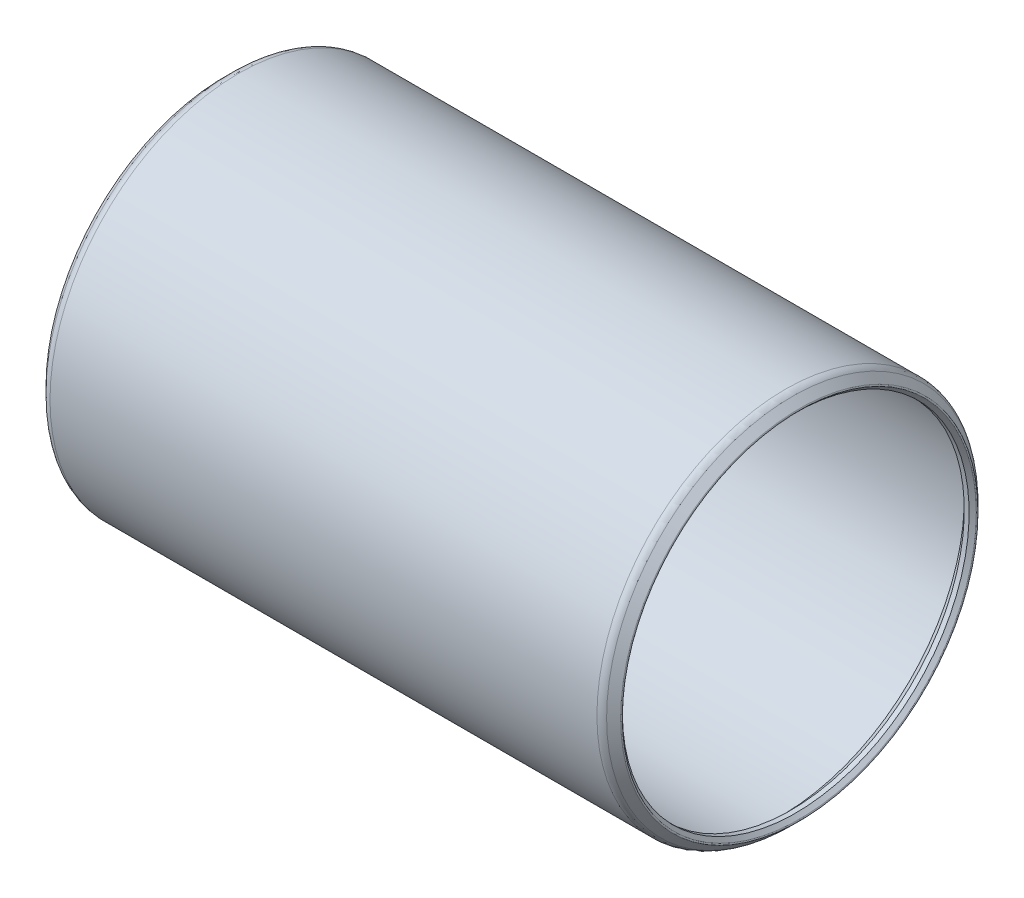
ISO-10303-21;
HEADER;
FILE_DESCRIPTION(('STEP AP214'),'2;1');
FILE_NAME('part.step','',(''),(''),'','','');
FILE_SCHEMA(('AUTOMOTIVE_DESIGN { 1 0 10303 214 1 1 1 1 }'));
ENDSEC;
DATA;
#1=APPLICATION_CONTEXT('core data for automotive mechanical design processes');
#2=APPLICATION_PROTOCOL_DEFINITION('international standard','automotive_design',2000,#1);
#3=PRODUCT_CONTEXT('',#1,'mechanical');
#4=PRODUCT('Part','Part','',(#3));
#5=PRODUCT_RELATED_PRODUCT_CATEGORY('part','',(#4));
#6=PRODUCT_DEFINITION_FORMATION('','',#4);
#7=PRODUCT_DEFINITION_CONTEXT('part definition',#1,'design');
#8=PRODUCT_DEFINITION('design','',#6,#7);
#9=PRODUCT_DEFINITION_SHAPE('','',#8);
#10=(LENGTH_UNIT() NAMED_UNIT(*) SI_UNIT(.MILLI.,.METRE.));
#11=(NAMED_UNIT(*) PLANE_ANGLE_UNIT() SI_UNIT($,.RADIAN.));
#12=(NAMED_UNIT(*) SI_UNIT($,.STERADIAN.) SOLID_ANGLE_UNIT());
#13=UNCERTAINTY_MEASURE_WITH_UNIT(LENGTH_MEASURE(1.E-05),#10,'distance_accuracy_value','');
#14=(GEOMETRIC_REPRESENTATION_CONTEXT(3) GLOBAL_UNCERTAINTY_ASSIGNED_CONTEXT((#13)) GLOBAL_UNIT_ASSIGNED_CONTEXT((#10,
#11,#12)) REPRESENTATION_CONTEXT('',''));
#15=CARTESIAN_POINT('',(0.,0.,0.));
#16=DIRECTION('',(0.,0.,1.));
#17=DIRECTION('',(1.,0.,0.));
#18=AXIS2_PLACEMENT_3D('',#15,#16,#17);
#19=CARTESIAN_POINT('',(-0.792815367264612,0.,0.));
#20=DIRECTION('',(-1.,0.,0.));
#21=DIRECTION('',(0.,0.,1.));
#22=AXIS2_PLACEMENT_3D('',#19,#20,#21);
#23=TOROIDAL_SURFACE('',#22,18.6444704896855,0.126999999999538);
#24=CARTESIAN_POINT('',(-0.882617928474841,0.,0.));
#25=DIRECTION('',(-1.,0.,0.));
#26=DIRECTION('',(0.,0.,1.));
#27=AXIS2_PLACEMENT_3D('',#24,#25,#26);
#28=CIRCLE('',#27,18.554667928475);
#29=CARTESIAN_POINT('',(-0.882617928474841,0.,18.554667928475));
#30=VERTEX_POINT('',#29);
#31=EDGE_CURVE('E10',#30,#30,#28,.T.);
#32=ORIENTED_EDGE('',*,*,#31,.F.);
#33=EDGE_LOOP('',(#32));
#34=FACE_BOUND('',#33,.T.);
#35=CARTESIAN_POINT('',(-0.882617928474841,0.,0.));
#36=DIRECTION('',(-1.,0.,0.));
#37=DIRECTION('',(0.,0.,1.));
#38=AXIS2_PLACEMENT_3D('',#35,#36,#37);
#39=CIRCLE('',#38,18.734273050896);
#40=CARTESIAN_POINT('',(-0.882617928474841,0.,18.734273050896));
#41=VERTEX_POINT('',#40);
#42=EDGE_CURVE('E78',#41,#41,#39,.T.);
#43=ORIENTED_EDGE('',*,*,#42,.T.);
#44=EDGE_LOOP('',(#43));
#45=FACE_BOUND('',#44,.T.);
#46=ADVANCED_FACE('F32',(#34,#45),#23,.T.);
#47=CARTESIAN_POINT('',(-0.882617928474841,0.,0.));
#48=DIRECTION('',(-1.,0.,0.));
#49=DIRECTION('',(0.,0.,1.));
#50=AXIS2_PLACEMENT_3D('',#47,#48,#49);
#51=CONICAL_SURFACE('',#50,18.554667928475,0.785398163397657);
#52=CARTESIAN_POINT('',(-0.508000000000002,0.,0.));
#53=DIRECTION('',(-1.,0.,0.));
#54=DIRECTION('',(0.,0.,1.));
#55=AXIS2_PLACEMENT_3D('',#52,#53,#54);
#56=CIRCLE('',#55,18.18005);
#57=CARTESIAN_POINT('',(-0.508000000000002,0.,18.18005));
#58=VERTEX_POINT('',#57);
#59=EDGE_CURVE('E38',#58,#58,#56,.T.);
#60=ORIENTED_EDGE('',*,*,#59,.F.);
#61=EDGE_LOOP('',(#60));
#62=FACE_BOUND('',#61,.T.);
#63=ORIENTED_EDGE('',*,*,#31,.T.);
#64=EDGE_LOOP('',(#63));
#65=FACE_BOUND('',#64,.T.);
#66=ADVANCED_FACE('F151',(#62,#65),#51,.F.);
#67=CARTESIAN_POINT('',(58.4835,0.,0.));
#68=DIRECTION('',(-1.,0.,0.));
#69=DIRECTION('',(0.,0.,1.));
#70=AXIS2_PLACEMENT_3D('',#67,#68,#69);
#71=CYLINDRICAL_SURFACE('',#70,18.18005);
#72=CARTESIAN_POINT('',(0.,0.,0.));
#73=DIRECTION('',(-1.,0.,0.));
#74=DIRECTION('',(0.,0.,1.));
#75=AXIS2_PLACEMENT_3D('',#72,#73,#74);
#76=CIRCLE('',#75,18.18005);
#77=CARTESIAN_POINT('',(0.,0.,18.18005));
#78=VERTEX_POINT('',#77);
#79=EDGE_CURVE('E42',#78,#78,#76,.T.);
#80=ORIENTED_EDGE('',*,*,#79,.F.);
#81=EDGE_LOOP('',(#80));
#82=FACE_BOUND('',#81,.T.);
#83=ORIENTED_EDGE('',*,*,#59,.T.);
#84=EDGE_LOOP('',(#83));
#85=FACE_BOUND('',#84,.T.);
#86=ADVANCED_FACE('F146',(#82,#85),#71,.F.);
#87=CARTESIAN_POINT('',(0.,0.,0.));
#88=DIRECTION('',(1.,0.,0.));
#89=DIRECTION('',(0.,0.,-1.));
#90=AXIS2_PLACEMENT_3D('',#87,#88,#89);
#91=CONICAL_SURFACE('',#90,18.18005,0.785398163397445);
#92=CARTESIAN_POINT('',(1.016,0.,0.));
#93=DIRECTION('',(-1.,0.,0.));
#94=DIRECTION('',(0.,0.,1.));
#95=AXIS2_PLACEMENT_3D('',#92,#93,#94);
#96=CIRCLE('',#95,19.19605);
#97=CARTESIAN_POINT('',(1.016,0.,19.19605));
#98=VERTEX_POINT('',#97);
#99=EDGE_CURVE('E46',#98,#98,#96,.T.);
#100=ORIENTED_EDGE('',*,*,#99,.F.);
#101=EDGE_LOOP('',(#100));
#102=FACE_BOUND('',#101,.T.);
#103=ORIENTED_EDGE('',*,*,#79,.T.);
#104=EDGE_LOOP('',(#103));
#105=FACE_BOUND('',#104,.T.);
#106=ADVANCED_FACE('F140',(#102,#105),#91,.F.);
#107=CARTESIAN_POINT('',(58.4835,0.,0.));
#108=DIRECTION('',(-1.,0.,0.));
#109=DIRECTION('',(0.,0.,1.));
#110=AXIS2_PLACEMENT_3D('',#107,#108,#109);
#111=CYLINDRICAL_SURFACE('',#110,19.19605);
#112=CARTESIAN_POINT('',(57.4675,0.,0.));
#113=DIRECTION('',(-1.,0.,0.));
#114=DIRECTION('',(0.,0.,1.));
#115=AXIS2_PLACEMENT_3D('',#112,#113,#114);
#116=CIRCLE('',#115,19.19605);
#117=CARTESIAN_POINT('',(57.4675,0.,19.19605));
#118=VERTEX_POINT('',#117);
#119=EDGE_CURVE('E51',#118,#118,#116,.T.);
#120=ORIENTED_EDGE('',*,*,#119,.F.);
#121=EDGE_LOOP('',(#120));
#122=FACE_BOUND('',#121,.T.);
#123=ORIENTED_EDGE('',*,*,#99,.T.);
#124=EDGE_LOOP('',(#123));
#125=FACE_BOUND('',#124,.T.);
#126=ADVANCED_FACE('F134',(#122,#125),#111,.F.);
#127=CARTESIAN_POINT('',(57.4675,0.,0.));
#128=DIRECTION('',(-1.,0.,0.));
#129=DIRECTION('',(0.,0.,1.));
#130=AXIS2_PLACEMENT_3D('',#127,#128,#129);
#131=CONICAL_SURFACE('',#130,19.19605,0.785398163397448);
#132=CARTESIAN_POINT('',(58.4835,0.,0.));
#133=DIRECTION('',(-1.,0.,0.));
#134=DIRECTION('',(0.,0.,1.));
#135=AXIS2_PLACEMENT_3D('',#132,#133,#134);
#136=CIRCLE('',#135,18.18005);
#137=CARTESIAN_POINT('',(58.4835,0.,18.18005));
#138=VERTEX_POINT('',#137);
#139=EDGE_CURVE('E54',#138,#138,#136,.T.);
#140=ORIENTED_EDGE('',*,*,#139,.F.);
#141=EDGE_LOOP('',(#140));
#142=FACE_BOUND('',#141,.T.);
#143=ORIENTED_EDGE('',*,*,#119,.T.);
#144=EDGE_LOOP('',(#143));
#145=FACE_BOUND('',#144,.T.);
#146=ADVANCED_FACE('F128',(#142,#145),#131,.F.);
#147=CARTESIAN_POINT('',(58.4835,0.,0.));
#148=DIRECTION('',(-1.,0.,0.));
#149=DIRECTION('',(0.,0.,1.));
#150=AXIS2_PLACEMENT_3D('',#147,#148,#149);
#151=CYLINDRICAL_SURFACE('',#150,18.18005);
#152=CARTESIAN_POINT('',(58.9915,0.,0.));
#153=DIRECTION('',(-1.,0.,0.));
#154=DIRECTION('',(0.,0.,1.));
#155=AXIS2_PLACEMENT_3D('',#152,#153,#154);
#156=CIRCLE('',#155,18.18005);
#157=CARTESIAN_POINT('',(58.9915,0.,18.18005));
#158=VERTEX_POINT('',#157);
#159=EDGE_CURVE('E57',#158,#158,#156,.T.);
#160=ORIENTED_EDGE('',*,*,#159,.F.);
#161=EDGE_LOOP('',(#160));
#162=FACE_BOUND('',#161,.T.);
#163=ORIENTED_EDGE('',*,*,#139,.T.);
#164=EDGE_LOOP('',(#163));
#165=FACE_BOUND('',#164,.T.);
#166=ADVANCED_FACE('F122',(#162,#165),#151,.F.);
#167=CARTESIAN_POINT('',(58.9915,0.,0.));
#168=DIRECTION('',(1.,0.,0.));
#169=DIRECTION('',(0.,0.,-1.));
#170=AXIS2_PLACEMENT_3D('',#167,#168,#169);
#171=CONICAL_SURFACE('',#170,18.18005,0.785398163396999);
#172=CARTESIAN_POINT('',(59.3661179284752,0.,0.));
#173=DIRECTION('',(-1.,0.,0.));
#174=DIRECTION('',(0.,0.,1.));
#175=AXIS2_PLACEMENT_3D('',#172,#173,#174);
#176=CIRCLE('',#175,18.5546679284748);
#177=CARTESIAN_POINT('',(59.3661179284752,0.,18.5546679284748));
#178=VERTEX_POINT('',#177);
#179=EDGE_CURVE('E60',#178,#178,#176,.T.);
#180=ORIENTED_EDGE('',*,*,#179,.F.);
#181=EDGE_LOOP('',(#180));
#182=FACE_BOUND('',#181,.T.);
#183=ORIENTED_EDGE('',*,*,#159,.T.);
#184=EDGE_LOOP('',(#183));
#185=FACE_BOUND('',#184,.T.);
#186=ADVANCED_FACE('F116',(#182,#185),#171,.F.);
#187=CARTESIAN_POINT('',(59.2763153672637,0.,0.));
#188=DIRECTION('',(-1.,0.,0.));
#189=DIRECTION('',(0.,0.,1.));
#190=AXIS2_PLACEMENT_3D('',#187,#188,#189);
#191=TOROIDAL_SURFACE('',#190,18.6444704896855,0.12700000000052);
#192=CARTESIAN_POINT('',(59.3661179284749,0.,0.));
#193=DIRECTION('',(-1.,0.,0.));
#194=DIRECTION('',(0.,0.,1.));
#195=AXIS2_PLACEMENT_3D('',#192,#193,#194);
#196=CIRCLE('',#195,18.7342730508967);
#197=CARTESIAN_POINT('',(59.3661179284749,0.,18.7342730508967));
#198=VERTEX_POINT('',#197);
#199=EDGE_CURVE('E63',#198,#198,#196,.T.);
#200=ORIENTED_EDGE('',*,*,#199,.F.);
#201=EDGE_LOOP('',(#200));
#202=FACE_BOUND('',#201,.T.);
#203=ORIENTED_EDGE('',*,*,#179,.T.);
#204=EDGE_LOOP('',(#203));
#205=FACE_BOUND('',#204,.T.);
#206=ADVANCED_FACE('F110',(#202,#205),#191,.T.);
#207=CARTESIAN_POINT('',(59.3661179284749,0.,0.));
#208=DIRECTION('',(-1.,0.,0.));
#209=DIRECTION('',(0.,0.,1.));
#210=AXIS2_PLACEMENT_3D('',#207,#208,#209);
#211=CONICAL_SURFACE('',#210,18.7342730508967,0.785398163397404);
#212=CARTESIAN_POINT('',(58.6304204896891,0.,0.));
#213=DIRECTION('',(-1.,0.,0.));
#214=DIRECTION('',(0.,0.,1.));
#215=AXIS2_PLACEMENT_3D('',#212,#213,#214);
#216=CIRCLE('',#215,19.4699704896825);
#217=CARTESIAN_POINT('',(58.6304204896891,0.,19.4699704896825));
#218=VERTEX_POINT('',#217);
#219=EDGE_CURVE('E66',#218,#218,#216,.T.);
#220=ORIENTED_EDGE('',*,*,#219,.F.);
#221=EDGE_LOOP('',(#220));
#222=FACE_BOUND('',#221,.T.);
#223=ORIENTED_EDGE('',*,*,#199,.T.);
#224=EDGE_LOOP('',(#223));
#225=FACE_BOUND('',#224,.T.);
#226=ADVANCED_FACE('F104',(#222,#225),#211,.T.);
#227=CARTESIAN_POINT('',(57.9119999999971,0.,0.));
#228=DIRECTION('',(-1.,0.,0.));
#229=DIRECTION('',(0.,0.,1.));
#230=AXIS2_PLACEMENT_3D('',#227,#228,#229);
#231=TOROIDAL_SURFACE('',#230,18.7515499999908,1.01600000000897);
#232=CARTESIAN_POINT('',(57.9119999999971,0.,0.));
#233=DIRECTION('',(-1.,0.,0.));
#234=DIRECTION('',(0.,0.,1.));
#235=AXIS2_PLACEMENT_3D('',#232,#233,#234);
#236=CIRCLE('',#235,19.7675499999997);
#237=CARTESIAN_POINT('',(57.9119999999971,0.,19.7675499999997));
#238=VERTEX_POINT('',#237);
#239=EDGE_CURVE('E69',#238,#238,#236,.T.);
#240=ORIENTED_EDGE('',*,*,#239,.F.);
#241=EDGE_LOOP('',(#240));
#242=FACE_BOUND('',#241,.T.);
#243=ORIENTED_EDGE('',*,*,#219,.T.);
#244=EDGE_LOOP('',(#243));
#245=FACE_BOUND('',#244,.T.);
#246=ADVANCED_FACE('F98',(#242,#245),#231,.T.);
#247=CARTESIAN_POINT('',(58.4835,0.,0.));
#248=DIRECTION('',(-1.,0.,0.));
#249=DIRECTION('',(0.,0.,1.));
#250=AXIS2_PLACEMENT_3D('',#247,#248,#249);
#251=CYLINDRICAL_SURFACE('',#250,19.7675499999996);
#252=CARTESIAN_POINT('',(0.571500000002952,0.,0.));
#253=DIRECTION('',(-1.,0.,0.));
#254=DIRECTION('',(0.,0.,1.));
#255=AXIS2_PLACEMENT_3D('',#252,#253,#254);
#256=CIRCLE('',#255,19.7675499999996);
#257=CARTESIAN_POINT('',(0.571500000002952,0.,19.7675499999996));
#258=VERTEX_POINT('',#257);
#259=EDGE_CURVE('E72',#258,#258,#256,.T.);
#260=ORIENTED_EDGE('',*,*,#259,.F.);
#261=EDGE_LOOP('',(#260));
#262=FACE_BOUND('',#261,.T.);
#263=ORIENTED_EDGE('',*,*,#239,.T.);
#264=EDGE_LOOP('',(#263));
#265=FACE_BOUND('',#264,.T.);
#266=ADVANCED_FACE('F92',(#262,#265),#251,.T.);
#267=CARTESIAN_POINT('',(0.57150000000261,0.,0.));
#268=DIRECTION('',(-1.,0.,0.));
#269=DIRECTION('',(0.,0.,1.));
#270=AXIS2_PLACEMENT_3D('',#267,#268,#269);
#271=TOROIDAL_SURFACE('',#270,18.7515499999926,1.01600000000701);
#272=CARTESIAN_POINT('',(-0.146920489687827,0.,0.));
#273=DIRECTION('',(-1.,0.,0.));
#274=DIRECTION('',(0.,0.,1.));
#275=AXIS2_PLACEMENT_3D('',#272,#273,#274);
#276=CIRCLE('',#275,19.469970489683);
#277=CARTESIAN_POINT('',(-0.146920489687827,0.,19.469970489683));
#278=VERTEX_POINT('',#277);
#279=EDGE_CURVE('E75',#278,#278,#276,.T.);
#280=ORIENTED_EDGE('',*,*,#279,.F.);
#281=EDGE_LOOP('',(#280));
#282=FACE_BOUND('',#281,.T.);
#283=ORIENTED_EDGE('',*,*,#259,.T.);
#284=EDGE_LOOP('',(#283));
#285=FACE_BOUND('',#284,.T.);
#286=ADVANCED_FACE('F86',(#282,#285),#271,.T.);
#287=CARTESIAN_POINT('',(-0.146920489687827,0.,0.));
#288=DIRECTION('',(1.,0.,0.));
#289=DIRECTION('',(0.,0.,-1.));
#290=AXIS2_PLACEMENT_3D('',#287,#288,#289);
#291=CONICAL_SURFACE('',#290,19.469970489683,0.785398163397451);
#292=ORIENTED_EDGE('',*,*,#42,.F.);
#293=EDGE_LOOP('',(#292));
#294=FACE_BOUND('',#293,.T.);
#295=ORIENTED_EDGE('',*,*,#279,.T.);
#296=EDGE_LOOP('',(#295));
#297=FACE_BOUND('',#296,.T.);
#298=ADVANCED_FACE('F83',(#294,#297),#291,.T.);
#299=CLOSED_SHELL('',(#46,#66,#86,#106,#126,#146,#166,#186,#206,#226,#246,#266,#286,#298));
#300=MANIFOLD_SOLID_BREP('B2',#299);
#301=ADVANCED_BREP_SHAPE_REPRESENTATION('',(#18,#300),#14);
#302=SHAPE_DEFINITION_REPRESENTATION(#9,#301);
ENDSEC;
END-ISO-10303-21;
